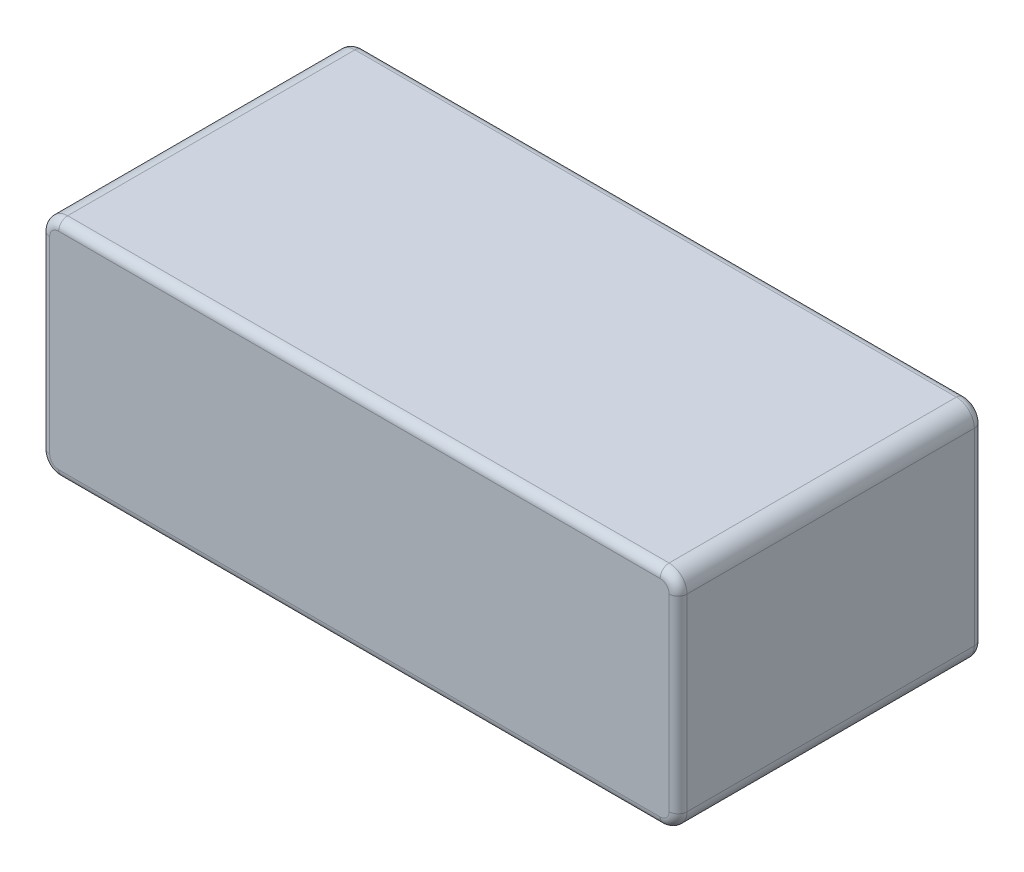
ISO-10303-21;
HEADER;
FILE_DESCRIPTION(('STEP AP214'),'2;1');
FILE_NAME('part.step','',(''),(''),'','','');
FILE_SCHEMA(('AUTOMOTIVE_DESIGN { 1 0 10303 214 1 1 1 1 }'));
ENDSEC;
DATA;
#1=APPLICATION_CONTEXT('core data for automotive mechanical design processes');
#2=APPLICATION_PROTOCOL_DEFINITION('international standard','automotive_design',2000,#1);
#3=PRODUCT_CONTEXT('',#1,'mechanical');
#4=PRODUCT('Part','Part','',(#3));
#5=PRODUCT_RELATED_PRODUCT_CATEGORY('part','',(#4));
#6=PRODUCT_DEFINITION_FORMATION('','',#4);
#7=PRODUCT_DEFINITION_CONTEXT('part definition',#1,'design');
#8=PRODUCT_DEFINITION('design','',#6,#7);
#9=PRODUCT_DEFINITION_SHAPE('','',#8);
#10=(LENGTH_UNIT() NAMED_UNIT(*) SI_UNIT(.MILLI.,.METRE.));
#11=(NAMED_UNIT(*) PLANE_ANGLE_UNIT() SI_UNIT($,.RADIAN.));
#12=(NAMED_UNIT(*) SI_UNIT($,.STERADIAN.) SOLID_ANGLE_UNIT());
#13=UNCERTAINTY_MEASURE_WITH_UNIT(LENGTH_MEASURE(1.E-05),#10,'distance_accuracy_value','');
#14=(GEOMETRIC_REPRESENTATION_CONTEXT(3) GLOBAL_UNCERTAINTY_ASSIGNED_CONTEXT((#13)) GLOBAL_UNIT_ASSIGNED_CONTEXT((#10,
#11,#12)) REPRESENTATION_CONTEXT('',''));
#15=CARTESIAN_POINT('',(0.,0.,0.));
#16=DIRECTION('',(0.,0.,1.));
#17=DIRECTION('',(1.,0.,0.));
#18=AXIS2_PLACEMENT_3D('',#15,#16,#17);
#19=CARTESIAN_POINT('',(71.,0.,34.));
#20=DIRECTION('',(-1.,0.,0.));
#21=DIRECTION('',(0.,0.,1.));
#22=AXIS2_PLACEMENT_3D('',#19,#20,#21);
#23=PLANE('',#22);
#24=DIRECTION('',(0.,0.,-1.));
#25=VECTOR('',#24,1.);
#26=CARTESIAN_POINT('',(71.,2.,34.));
#27=LINE('',#26,#25);
#28=CARTESIAN_POINT('',(71.,2.,33.));
#29=VERTEX_POINT('',#28);
#30=CARTESIAN_POINT('',(71.,2.,1.));
#31=VERTEX_POINT('',#30);
#32=EDGE_CURVE('E329',#29,#31,#27,.T.);
#33=ORIENTED_EDGE('',*,*,#32,.T.);
#34=DIRECTION('',(0.,1.,0.));
#35=VECTOR('',#34,1.);
#36=CARTESIAN_POINT('',(71.,23.,1.));
#37=LINE('',#36,#35);
#38=CARTESIAN_POINT('',(71.,23.,1.));
#39=VERTEX_POINT('',#38);
#40=EDGE_CURVE('E243',#31,#39,#37,.T.);
#41=ORIENTED_EDGE('',*,*,#40,.T.);
#42=DIRECTION('',(0.,0.,-1.));
#43=VECTOR('',#42,1.);
#44=CARTESIAN_POINT('',(71.,23.,34.));
#45=LINE('',#44,#43);
#46=CARTESIAN_POINT('',(71.,23.,33.));
#47=VERTEX_POINT('',#46);
#48=EDGE_CURVE('E326',#39,#47,#45,.F.);
#49=ORIENTED_EDGE('',*,*,#48,.T.);
#50=DIRECTION('',(0.,1.,0.));
#51=VECTOR('',#50,1.);
#52=CARTESIAN_POINT('',(71.,0.,33.));
#53=LINE('',#52,#51);
#54=EDGE_CURVE('E183',#47,#29,#53,.F.);
#55=ORIENTED_EDGE('',*,*,#54,.T.);
#56=EDGE_LOOP('',(#33,#41,#49,#55));
#57=FACE_BOUND('',#56,.T.);
#58=ADVANCED_FACE('F41',(#57),#23,.F.);
#59=CARTESIAN_POINT('',(0.,25.,34.));
#60=DIRECTION('',(0.,-1.,0.));
#61=DIRECTION('',(1.,0.,0.));
#62=AXIS2_PLACEMENT_3D('',#59,#60,#61);
#63=PLANE('',#62);
#64=DIRECTION('',(0.,0.,-1.));
#65=VECTOR('',#64,1.);
#66=CARTESIAN_POINT('',(69.,25.,34.));
#67=LINE('',#66,#65);
#68=CARTESIAN_POINT('',(69.,25.,33.));
#69=VERTEX_POINT('',#68);
#70=CARTESIAN_POINT('',(69.,25.,1.));
#71=VERTEX_POINT('',#70);
#72=EDGE_CURVE('E223',#69,#71,#67,.T.);
#73=ORIENTED_EDGE('',*,*,#72,.T.);
#74=DIRECTION('',(-1.,0.,0.));
#75=VECTOR('',#74,1.);
#76=CARTESIAN_POINT('',(1.99999999999999,25.,1.));
#77=LINE('',#76,#75);
#78=CARTESIAN_POINT('',(1.99999999999999,25.,1.));
#79=VERTEX_POINT('',#78);
#80=EDGE_CURVE('E11',#71,#79,#77,.T.);
#81=ORIENTED_EDGE('',*,*,#80,.T.);
#82=DIRECTION('',(0.,0.,-1.));
#83=VECTOR('',#82,1.);
#84=CARTESIAN_POINT('',(1.99999999999999,25.,34.));
#85=LINE('',#84,#83);
#86=CARTESIAN_POINT('',(1.99999999999999,25.,33.));
#87=VERTEX_POINT('',#86);
#88=EDGE_CURVE('E296',#79,#87,#85,.F.);
#89=ORIENTED_EDGE('',*,*,#88,.T.);
#90=DIRECTION('',(-1.,0.,0.));
#91=VECTOR('',#90,1.);
#92=CARTESIAN_POINT('',(0.,25.,33.));
#93=LINE('',#92,#91);
#94=EDGE_CURVE('E203',#87,#69,#93,.F.);
#95=ORIENTED_EDGE('',*,*,#94,.T.);
#96=EDGE_LOOP('',(#73,#81,#89,#95));
#97=FACE_BOUND('',#96,.T.);
#98=ADVANCED_FACE('F345',(#97),#63,.F.);
#99=CARTESIAN_POINT('',(0.,25.,34.));
#100=DIRECTION('',(1.,0.,0.));
#101=DIRECTION('',(0.,1.,0.));
#102=AXIS2_PLACEMENT_3D('',#99,#100,#101);
#103=PLANE('',#102);
#104=DIRECTION('',(0.,0.,-1.));
#105=VECTOR('',#104,1.);
#106=CARTESIAN_POINT('',(0.,23.,34.));
#107=LINE('',#106,#105);
#108=CARTESIAN_POINT('',(0.,23.,33.));
#109=VERTEX_POINT('',#108);
#110=CARTESIAN_POINT('',(0.,23.,1.));
#111=VERTEX_POINT('',#110);
#112=EDGE_CURVE('E299',#109,#111,#107,.T.);
#113=ORIENTED_EDGE('',*,*,#112,.T.);
#114=DIRECTION('',(0.,-1.,0.));
#115=VECTOR('',#114,1.);
#116=CARTESIAN_POINT('',(0.,2.,1.));
#117=LINE('',#116,#115);
#118=CARTESIAN_POINT('',(0.,2.,1.));
#119=VERTEX_POINT('',#118);
#120=EDGE_CURVE('E251',#111,#119,#117,.T.);
#121=ORIENTED_EDGE('',*,*,#120,.T.);
#122=DIRECTION('',(0.,0.,-1.));
#123=VECTOR('',#122,1.);
#124=CARTESIAN_POINT('',(0.,2.,34.));
#125=LINE('',#124,#123);
#126=CARTESIAN_POINT('',(0.,2.,33.));
#127=VERTEX_POINT('',#126);
#128=EDGE_CURVE('E176',#119,#127,#125,.F.);
#129=ORIENTED_EDGE('',*,*,#128,.T.);
#130=DIRECTION('',(0.,-1.,0.));
#131=VECTOR('',#130,1.);
#132=CARTESIAN_POINT('',(0.,25.,33.));
#133=LINE('',#132,#131);
#134=EDGE_CURVE('E198',#127,#109,#133,.F.);
#135=ORIENTED_EDGE('',*,*,#134,.T.);
#136=EDGE_LOOP('',(#113,#121,#129,#135));
#137=FACE_BOUND('',#136,.T.);
#138=ADVANCED_FACE('F335',(#137),#103,.F.);
#139=CARTESIAN_POINT('',(0.,0.,34.));
#140=DIRECTION('',(0.,1.,0.));
#141=DIRECTION('',(0.,0.,1.));
#142=AXIS2_PLACEMENT_3D('',#139,#140,#141);
#143=PLANE('',#142);
#144=DIRECTION('',(0.,0.,-1.));
#145=VECTOR('',#144,1.);
#146=CARTESIAN_POINT('',(2.,0.,34.));
#147=LINE('',#146,#145);
#148=CARTESIAN_POINT('',(2.,0.,33.));
#149=VERTEX_POINT('',#148);
#150=CARTESIAN_POINT('',(2.,0.,1.));
#151=VERTEX_POINT('',#150);
#152=EDGE_CURVE('E290',#149,#151,#147,.T.);
#153=ORIENTED_EDGE('',*,*,#152,.T.);
#154=DIRECTION('',(1.,0.,0.));
#155=VECTOR('',#154,1.);
#156=CARTESIAN_POINT('',(69.,0.,1.));
#157=LINE('',#156,#155);
#158=CARTESIAN_POINT('',(69.,0.,1.));
#159=VERTEX_POINT('',#158);
#160=EDGE_CURVE('E247',#151,#159,#157,.T.);
#161=ORIENTED_EDGE('',*,*,#160,.T.);
#162=DIRECTION('',(0.,0.,-1.));
#163=VECTOR('',#162,1.);
#164=CARTESIAN_POINT('',(69.,0.,34.));
#165=LINE('',#164,#163);
#166=CARTESIAN_POINT('',(69.,0.,33.));
#167=VERTEX_POINT('',#166);
#168=EDGE_CURVE('E333',#159,#167,#165,.F.);
#169=ORIENTED_EDGE('',*,*,#168,.T.);
#170=DIRECTION('',(1.,0.,0.));
#171=VECTOR('',#170,1.);
#172=CARTESIAN_POINT('',(0.,0.,33.));
#173=LINE('',#172,#171);
#174=EDGE_CURVE('E193',#167,#149,#173,.F.);
#175=ORIENTED_EDGE('',*,*,#174,.T.);
#176=EDGE_LOOP('',(#153,#161,#169,#175));
#177=FACE_BOUND('',#176,.T.);
#178=ADVANCED_FACE('F293',(#177),#143,.F.);
#179=CARTESIAN_POINT('',(0.,0.,34.));
#180=DIRECTION('',(0.,0.,-1.));
#181=DIRECTION('',(-1.,0.,0.));
#182=AXIS2_PLACEMENT_3D('',#179,#180,#181);
#183=PLANE('',#182);
#184=DIRECTION('',(0.,1.,0.));
#185=VECTOR('',#184,1.);
#186=CARTESIAN_POINT('',(70.,0.,34.));
#187=LINE('',#186,#185);
#188=CARTESIAN_POINT('',(70.,2.,34.));
#189=VERTEX_POINT('',#188);
#190=CARTESIAN_POINT('',(70.,23.,34.));
#191=VERTEX_POINT('',#190);
#192=EDGE_CURVE('E180',#189,#191,#187,.T.);
#193=ORIENTED_EDGE('',*,*,#192,.T.);
#194=CARTESIAN_POINT('',(69.,23.,34.));
#195=DIRECTION('',(0.,0.,-1.));
#196=DIRECTION('',(-1.,0.,0.));
#197=AXIS2_PLACEMENT_3D('',#194,#195,#196);
#198=CIRCLE('',#197,1.);
#199=CARTESIAN_POINT('',(69.,24.,34.));
#200=VERTEX_POINT('',#199);
#201=EDGE_CURVE('E161',#191,#200,#198,.F.);
#202=ORIENTED_EDGE('',*,*,#201,.T.);
#203=DIRECTION('',(-1.,0.,0.));
#204=VECTOR('',#203,1.);
#205=CARTESIAN_POINT('',(0.,24.,34.));
#206=LINE('',#205,#204);
#207=CARTESIAN_POINT('',(1.99999999999999,24.,34.));
#208=VERTEX_POINT('',#207);
#209=EDGE_CURVE('E169',#200,#208,#206,.T.);
#210=ORIENTED_EDGE('',*,*,#209,.T.);
#211=CARTESIAN_POINT('',(1.99999999999999,23.,34.));
#212=DIRECTION('',(0.,0.,-1.));
#213=DIRECTION('',(-1.,0.,0.));
#214=AXIS2_PLACEMENT_3D('',#211,#212,#213);
#215=CIRCLE('',#214,1.);
#216=CARTESIAN_POINT('',(0.999999999999993,23.,34.));
#217=VERTEX_POINT('',#216);
#218=EDGE_CURVE('E175',#208,#217,#215,.F.);
#219=ORIENTED_EDGE('',*,*,#218,.T.);
#220=DIRECTION('',(0.,-1.,0.));
#221=VECTOR('',#220,1.);
#222=CARTESIAN_POINT('',(1.,0.,34.));
#223=LINE('',#222,#221);
#224=CARTESIAN_POINT('',(0.999999999999999,2.,34.));
#225=VERTEX_POINT('',#224);
#226=EDGE_CURVE('E304',#217,#225,#223,.T.);
#227=ORIENTED_EDGE('',*,*,#226,.T.);
#228=CARTESIAN_POINT('',(2.,2.,34.));
#229=DIRECTION('',(0.,0.,-1.));
#230=DIRECTION('',(-1.,0.,0.));
#231=AXIS2_PLACEMENT_3D('',#228,#229,#230);
#232=CIRCLE('',#231,1.);
#233=CARTESIAN_POINT('',(2.,1.,34.));
#234=VERTEX_POINT('',#233);
#235=EDGE_CURVE('E306',#225,#234,#232,.F.);
#236=ORIENTED_EDGE('',*,*,#235,.T.);
#237=DIRECTION('',(1.,0.,0.));
#238=VECTOR('',#237,1.);
#239=CARTESIAN_POINT('',(0.,1.,34.));
#240=LINE('',#239,#238);
#241=CARTESIAN_POINT('',(69.,1.,34.));
#242=VERTEX_POINT('',#241);
#243=EDGE_CURVE('E308',#234,#242,#240,.T.);
#244=ORIENTED_EDGE('',*,*,#243,.T.);
#245=CARTESIAN_POINT('',(69.,2.,34.));
#246=DIRECTION('',(0.,0.,-1.));
#247=DIRECTION('',(-1.,0.,0.));
#248=AXIS2_PLACEMENT_3D('',#245,#246,#247);
#249=CIRCLE('',#248,1.);
#250=EDGE_CURVE('E185',#242,#189,#249,.F.);
#251=ORIENTED_EDGE('',*,*,#250,.T.);
#252=EDGE_LOOP('',(#193,#202,#210,#219,#227,#236,#244,#251));
#253=FACE_BOUND('',#252,.T.);
#254=ADVANCED_FACE('F178',(#253),#183,.F.);
#255=CARTESIAN_POINT('',(0.,0.,0.));
#256=DIRECTION('',(0.,0.,-1.));
#257=DIRECTION('',(-1.,0.,0.));
#258=AXIS2_PLACEMENT_3D('',#255,#256,#257);
#259=PLANE('',#258);
#260=DIRECTION('',(-1.,0.,0.));
#261=VECTOR('',#260,1.);
#262=CARTESIAN_POINT('',(69.,24.,0.));
#263=LINE('',#262,#261);
#264=CARTESIAN_POINT('',(1.99999999999999,24.,0.));
#265=VERTEX_POINT('',#264);
#266=CARTESIAN_POINT('',(69.,24.,0.));
#267=VERTEX_POINT('',#266);
#268=EDGE_CURVE('E204',#265,#267,#263,.F.);
#269=ORIENTED_EDGE('',*,*,#268,.T.);
#270=CARTESIAN_POINT('',(69.,23.,0.));
#271=DIRECTION('',(0.,0.,-1.));
#272=DIRECTION('',(-1.,0.,0.));
#273=AXIS2_PLACEMENT_3D('',#270,#271,#272);
#274=CIRCLE('',#273,1.);
#275=CARTESIAN_POINT('',(70.,23.,0.));
#276=VERTEX_POINT('',#275);
#277=EDGE_CURVE('E237',#267,#276,#274,.T.);
#278=ORIENTED_EDGE('',*,*,#277,.T.);
#279=DIRECTION('',(0.,1.,0.));
#280=VECTOR('',#279,1.);
#281=CARTESIAN_POINT('',(70.,2.,0.));
#282=LINE('',#281,#280);
#283=CARTESIAN_POINT('',(70.,2.,0.));
#284=VERTEX_POINT('',#283);
#285=EDGE_CURVE('E235',#276,#284,#282,.F.);
#286=ORIENTED_EDGE('',*,*,#285,.T.);
#287=CARTESIAN_POINT('',(69.,2.,0.));
#288=DIRECTION('',(0.,0.,-1.));
#289=DIRECTION('',(-1.,0.,0.));
#290=AXIS2_PLACEMENT_3D('',#287,#288,#289);
#291=CIRCLE('',#290,1.);
#292=CARTESIAN_POINT('',(69.,1.,0.));
#293=VERTEX_POINT('',#292);
#294=EDGE_CURVE('E233',#284,#293,#291,.T.);
#295=ORIENTED_EDGE('',*,*,#294,.T.);
#296=DIRECTION('',(1.,0.,0.));
#297=VECTOR('',#296,1.);
#298=CARTESIAN_POINT('',(2.,1.,0.));
#299=LINE('',#298,#297);
#300=CARTESIAN_POINT('',(2.,1.,0.));
#301=VERTEX_POINT('',#300);
#302=EDGE_CURVE('E231',#293,#301,#299,.F.);
#303=ORIENTED_EDGE('',*,*,#302,.T.);
#304=CARTESIAN_POINT('',(2.,2.,0.));
#305=DIRECTION('',(0.,0.,-1.));
#306=DIRECTION('',(-1.,0.,0.));
#307=AXIS2_PLACEMENT_3D('',#304,#305,#306);
#308=CIRCLE('',#307,1.);
#309=CARTESIAN_POINT('',(1.,2.,0.));
#310=VERTEX_POINT('',#309);
#311=EDGE_CURVE('E229',#301,#310,#308,.T.);
#312=ORIENTED_EDGE('',*,*,#311,.T.);
#313=DIRECTION('',(0.,-1.,0.));
#314=VECTOR('',#313,1.);
#315=CARTESIAN_POINT('',(0.999999999999993,23.,0.));
#316=LINE('',#315,#314);
#317=CARTESIAN_POINT('',(0.999999999999993,23.,0.));
#318=VERTEX_POINT('',#317);
#319=EDGE_CURVE('E227',#310,#318,#316,.F.);
#320=ORIENTED_EDGE('',*,*,#319,.T.);
#321=CARTESIAN_POINT('',(1.99999999999999,23.,0.));
#322=DIRECTION('',(0.,0.,-1.));
#323=DIRECTION('',(-1.,0.,0.));
#324=AXIS2_PLACEMENT_3D('',#321,#322,#323);
#325=CIRCLE('',#324,1.);
#326=EDGE_CURVE('E225',#318,#265,#325,.T.);
#327=ORIENTED_EDGE('',*,*,#326,.T.);
#328=EDGE_LOOP('',(#269,#278,#286,#295,#303,#312,#320,#327));
#329=FACE_BOUND('',#328,.T.);
#330=ADVANCED_FACE('F356',(#329),#259,.T.);
#331=CARTESIAN_POINT('',(69.,23.,34.));
#332=DIRECTION('',(0.,0.,-1.));
#333=DIRECTION('',(-1.,0.,0.));
#334=AXIS2_PLACEMENT_3D('',#331,#332,#333);
#335=CYLINDRICAL_SURFACE('',#334,2.);
#336=ORIENTED_EDGE('',*,*,#48,.F.);
#337=CARTESIAN_POINT('',(69.,23.,1.));
#338=DIRECTION('',(0.,0.,-1.));
#339=DIRECTION('',(-1.,0.,0.));
#340=AXIS2_PLACEMENT_3D('',#337,#338,#339);
#341=CIRCLE('',#340,2.);
#342=EDGE_CURVE('E240',#39,#71,#341,.F.);
#343=ORIENTED_EDGE('',*,*,#342,.T.);
#344=ORIENTED_EDGE('',*,*,#72,.F.);
#345=CARTESIAN_POINT('',(69.,23.,33.));
#346=DIRECTION('',(0.,0.,-1.));
#347=DIRECTION('',(-1.,0.,0.));
#348=AXIS2_PLACEMENT_3D('',#345,#346,#347);
#349=CIRCLE('',#348,2.);
#350=EDGE_CURVE('E163',#69,#47,#349,.T.);
#351=ORIENTED_EDGE('',*,*,#350,.T.);
#352=EDGE_LOOP('',(#336,#343,#344,#351));
#353=FACE_BOUND('',#352,.T.);
#354=ADVANCED_FACE('F325',(#353),#335,.T.);
#355=CARTESIAN_POINT('',(69.,2.,34.));
#356=DIRECTION('',(0.,0.,-1.));
#357=DIRECTION('',(-1.,0.,0.));
#358=AXIS2_PLACEMENT_3D('',#355,#356,#357);
#359=CYLINDRICAL_SURFACE('',#358,2.);
#360=ORIENTED_EDGE('',*,*,#168,.F.);
#361=CARTESIAN_POINT('',(69.,2.,1.));
#362=DIRECTION('',(0.,0.,-1.));
#363=DIRECTION('',(-1.,0.,0.));
#364=AXIS2_PLACEMENT_3D('',#361,#362,#363);
#365=CIRCLE('',#364,2.);
#366=EDGE_CURVE('E245',#159,#31,#365,.F.);
#367=ORIENTED_EDGE('',*,*,#366,.T.);
#368=ORIENTED_EDGE('',*,*,#32,.F.);
#369=CARTESIAN_POINT('',(69.,2.,33.));
#370=DIRECTION('',(0.,0.,-1.));
#371=DIRECTION('',(-1.,0.,0.));
#372=AXIS2_PLACEMENT_3D('',#369,#370,#371);
#373=CIRCLE('',#372,2.);
#374=EDGE_CURVE('E190',#29,#167,#373,.T.);
#375=ORIENTED_EDGE('',*,*,#374,.T.);
#376=EDGE_LOOP('',(#360,#367,#368,#375));
#377=FACE_BOUND('',#376,.T.);
#378=ADVANCED_FACE('F366',(#377),#359,.T.);
#379=CARTESIAN_POINT('',(1.99999999999999,23.,34.));
#380=DIRECTION('',(0.,0.,-1.));
#381=DIRECTION('',(-1.,0.,0.));
#382=AXIS2_PLACEMENT_3D('',#379,#380,#381);
#383=CYLINDRICAL_SURFACE('',#382,2.);
#384=ORIENTED_EDGE('',*,*,#88,.F.);
#385=CARTESIAN_POINT('',(1.99999999999999,23.,1.));
#386=DIRECTION('',(0.,0.,-1.));
#387=DIRECTION('',(-1.,0.,0.));
#388=AXIS2_PLACEMENT_3D('',#385,#386,#387);
#389=CIRCLE('',#388,2.);
#390=EDGE_CURVE('E50',#79,#111,#389,.F.);
#391=ORIENTED_EDGE('',*,*,#390,.T.);
#392=ORIENTED_EDGE('',*,*,#112,.F.);
#393=CARTESIAN_POINT('',(1.99999999999999,23.,33.));
#394=DIRECTION('',(0.,0.,-1.));
#395=DIRECTION('',(-1.,0.,0.));
#396=AXIS2_PLACEMENT_3D('',#393,#394,#395);
#397=CIRCLE('',#396,2.);
#398=EDGE_CURVE('E200',#109,#87,#397,.T.);
#399=ORIENTED_EDGE('',*,*,#398,.T.);
#400=EDGE_LOOP('',(#384,#391,#392,#399));
#401=FACE_BOUND('',#400,.T.);
#402=ADVANCED_FACE('F338',(#401),#383,.T.);
#403=CARTESIAN_POINT('',(2.,2.,34.));
#404=DIRECTION('',(0.,0.,-1.));
#405=DIRECTION('',(-1.,0.,0.));
#406=AXIS2_PLACEMENT_3D('',#403,#404,#405);
#407=CYLINDRICAL_SURFACE('',#406,2.);
#408=ORIENTED_EDGE('',*,*,#128,.F.);
#409=CARTESIAN_POINT('',(2.,2.,1.));
#410=DIRECTION('',(0.,0.,-1.));
#411=DIRECTION('',(-1.,0.,0.));
#412=AXIS2_PLACEMENT_3D('',#409,#410,#411);
#413=CIRCLE('',#412,2.);
#414=EDGE_CURVE('E249',#119,#151,#413,.F.);
#415=ORIENTED_EDGE('',*,*,#414,.T.);
#416=ORIENTED_EDGE('',*,*,#152,.F.);
#417=CARTESIAN_POINT('',(2.,2.,33.));
#418=DIRECTION('',(0.,0.,-1.));
#419=DIRECTION('',(-1.,0.,0.));
#420=AXIS2_PLACEMENT_3D('',#417,#418,#419);
#421=CIRCLE('',#420,2.);
#422=EDGE_CURVE('E195',#149,#127,#421,.T.);
#423=ORIENTED_EDGE('',*,*,#422,.T.);
#424=EDGE_LOOP('',(#408,#415,#416,#423));
#425=FACE_BOUND('',#424,.T.);
#426=ADVANCED_FACE('F289',(#425),#407,.T.);
#427=CARTESIAN_POINT('',(2.,2.,33.));
#428=DIRECTION('',(0.,0.,-1.));
#429=DIRECTION('',(-1.,0.,0.));
#430=AXIS2_PLACEMENT_3D('',#427,#428,#429);
#431=DEGENERATE_TOROIDAL_SURFACE('',#430,1.,1.,.T.);
#432=CARTESIAN_POINT('',(0.999999999999999,2.,33.));
#433=DIRECTION('',(0.,1.,0.));
#434=DIRECTION('',(-1.,0.,0.));
#435=AXIS2_PLACEMENT_3D('',#432,#433,#434);
#436=CIRCLE('',#435,1.);
#437=EDGE_CURVE('E217',#127,#225,#436,.T.);
#438=ORIENTED_EDGE('',*,*,#437,.F.);
#439=ORIENTED_EDGE('',*,*,#422,.F.);
#440=CARTESIAN_POINT('',(2.,1.,33.));
#441=DIRECTION('',(1.,0.,0.));
#442=DIRECTION('',(0.,0.,-1.));
#443=AXIS2_PLACEMENT_3D('',#440,#441,#442);
#444=CIRCLE('',#443,1.);
#445=EDGE_CURVE('E220',#234,#149,#444,.T.);
#446=ORIENTED_EDGE('',*,*,#445,.F.);
#447=ORIENTED_EDGE('',*,*,#235,.F.);
#448=EDGE_LOOP('',(#438,#439,#446,#447));
#449=FACE_BOUND('',#448,.T.);
#450=ADVANCED_FACE('F396',(#449),#431,.T.);
#451=CARTESIAN_POINT('',(0.,1.,33.));
#452=DIRECTION('',(1.,0.,0.));
#453=DIRECTION('',(0.,0.,-1.));
#454=AXIS2_PLACEMENT_3D('',#451,#452,#453);
#455=CYLINDRICAL_SURFACE('',#454,1.);
#456=ORIENTED_EDGE('',*,*,#445,.T.);
#457=ORIENTED_EDGE('',*,*,#174,.F.);
#458=CARTESIAN_POINT('',(69.,1.,33.));
#459=DIRECTION('',(1.,0.,0.));
#460=DIRECTION('',(0.,0.,-1.));
#461=AXIS2_PLACEMENT_3D('',#458,#459,#460);
#462=CIRCLE('',#461,1.);
#463=EDGE_CURVE('E214',#242,#167,#462,.T.);
#464=ORIENTED_EDGE('',*,*,#463,.F.);
#465=ORIENTED_EDGE('',*,*,#243,.F.);
#466=EDGE_LOOP('',(#456,#457,#464,#465));
#467=FACE_BOUND('',#466,.T.);
#468=ADVANCED_FACE('F409',(#467),#455,.T.);
#469=CARTESIAN_POINT('',(1.,0.,33.));
#470=DIRECTION('',(0.,-1.,0.));
#471=DIRECTION('',(1.,0.,0.));
#472=AXIS2_PLACEMENT_3D('',#469,#470,#471);
#473=CYLINDRICAL_SURFACE('',#472,1.);
#474=ORIENTED_EDGE('',*,*,#437,.T.);
#475=ORIENTED_EDGE('',*,*,#226,.F.);
#476=CARTESIAN_POINT('',(0.999999999999993,23.,33.));
#477=DIRECTION('',(0.,1.,0.));
#478=DIRECTION('',(0.,0.,1.));
#479=AXIS2_PLACEMENT_3D('',#476,#477,#478);
#480=CIRCLE('',#479,1.);
#481=EDGE_CURVE('E211',#109,#217,#480,.T.);
#482=ORIENTED_EDGE('',*,*,#481,.F.);
#483=ORIENTED_EDGE('',*,*,#134,.F.);
#484=EDGE_LOOP('',(#474,#475,#482,#483));
#485=FACE_BOUND('',#484,.T.);
#486=ADVANCED_FACE('F342',(#485),#473,.T.);
#487=CARTESIAN_POINT('',(69.,2.,33.));
#488=DIRECTION('',(0.,0.,-1.));
#489=DIRECTION('',(-1.,0.,0.));
#490=AXIS2_PLACEMENT_3D('',#487,#488,#489);
#491=DEGENERATE_TOROIDAL_SURFACE('',#490,1.,1.,.T.);
#492=ORIENTED_EDGE('',*,*,#463,.T.);
#493=ORIENTED_EDGE('',*,*,#374,.F.);
#494=CARTESIAN_POINT('',(70.,2.,33.));
#495=DIRECTION('',(0.,1.,0.));
#496=DIRECTION('',(0.,0.,1.));
#497=AXIS2_PLACEMENT_3D('',#494,#495,#496);
#498=CIRCLE('',#497,1.);
#499=EDGE_CURVE('E208',#189,#29,#498,.T.);
#500=ORIENTED_EDGE('',*,*,#499,.F.);
#501=ORIENTED_EDGE('',*,*,#250,.F.);
#502=EDGE_LOOP('',(#492,#493,#500,#501));
#503=FACE_BOUND('',#502,.T.);
#504=ADVANCED_FACE('F315',(#503),#491,.T.);
#505=CARTESIAN_POINT('',(1.99999999999999,23.,33.));
#506=DIRECTION('',(0.,0.,-1.));
#507=DIRECTION('',(-1.,0.,0.));
#508=AXIS2_PLACEMENT_3D('',#505,#506,#507);
#509=DEGENERATE_TOROIDAL_SURFACE('',#508,1.,1.,.T.);
#510=ORIENTED_EDGE('',*,*,#481,.T.);
#511=ORIENTED_EDGE('',*,*,#218,.F.);
#512=CARTESIAN_POINT('',(1.99999999999999,24.,33.));
#513=DIRECTION('',(1.,0.,0.));
#514=DIRECTION('',(0.,0.,-1.));
#515=AXIS2_PLACEMENT_3D('',#512,#513,#514);
#516=CIRCLE('',#515,1.);
#517=EDGE_CURVE('E172',#87,#208,#516,.T.);
#518=ORIENTED_EDGE('',*,*,#517,.F.);
#519=ORIENTED_EDGE('',*,*,#398,.F.);
#520=EDGE_LOOP('',(#510,#511,#518,#519));
#521=FACE_BOUND('',#520,.T.);
#522=ADVANCED_FACE('F344',(#521),#509,.T.);
#523=CARTESIAN_POINT('',(70.,0.,33.));
#524=DIRECTION('',(0.,1.,0.));
#525=DIRECTION('',(0.,0.,1.));
#526=AXIS2_PLACEMENT_3D('',#523,#524,#525);
#527=CYLINDRICAL_SURFACE('',#526,1.);
#528=ORIENTED_EDGE('',*,*,#499,.T.);
#529=ORIENTED_EDGE('',*,*,#54,.F.);
#530=CARTESIAN_POINT('',(70.,23.,33.));
#531=DIRECTION('',(0.,1.,0.));
#532=DIRECTION('',(0.,0.,1.));
#533=AXIS2_PLACEMENT_3D('',#530,#531,#532);
#534=CIRCLE('',#533,1.);
#535=EDGE_CURVE('E166',#191,#47,#534,.T.);
#536=ORIENTED_EDGE('',*,*,#535,.F.);
#537=ORIENTED_EDGE('',*,*,#192,.F.);
#538=EDGE_LOOP('',(#528,#529,#536,#537));
#539=FACE_BOUND('',#538,.T.);
#540=ADVANCED_FACE('F318',(#539),#527,.T.);
#541=CARTESIAN_POINT('',(0.,24.,33.));
#542=DIRECTION('',(-1.,0.,0.));
#543=DIRECTION('',(0.,-1.,0.));
#544=AXIS2_PLACEMENT_3D('',#541,#542,#543);
#545=CYLINDRICAL_SURFACE('',#544,1.);
#546=ORIENTED_EDGE('',*,*,#517,.T.);
#547=ORIENTED_EDGE('',*,*,#209,.F.);
#548=CARTESIAN_POINT('',(69.,24.,33.));
#549=DIRECTION('',(1.,0.,0.));
#550=DIRECTION('',(0.,0.,-1.));
#551=AXIS2_PLACEMENT_3D('',#548,#549,#550);
#552=CIRCLE('',#551,1.);
#553=EDGE_CURVE('E156',#69,#200,#552,.T.);
#554=ORIENTED_EDGE('',*,*,#553,.F.);
#555=ORIENTED_EDGE('',*,*,#94,.F.);
#556=EDGE_LOOP('',(#546,#547,#554,#555));
#557=FACE_BOUND('',#556,.T.);
#558=ADVANCED_FACE('F170',(#557),#545,.T.);
#559=CARTESIAN_POINT('',(69.,23.,33.));
#560=DIRECTION('',(0.,0.,-1.));
#561=DIRECTION('',(-1.,0.,0.));
#562=AXIS2_PLACEMENT_3D('',#559,#560,#561);
#563=DEGENERATE_TOROIDAL_SURFACE('',#562,1.,1.,.T.);
#564=ORIENTED_EDGE('',*,*,#535,.T.);
#565=ORIENTED_EDGE('',*,*,#350,.F.);
#566=ORIENTED_EDGE('',*,*,#553,.T.);
#567=ORIENTED_EDGE('',*,*,#201,.F.);
#568=EDGE_LOOP('',(#564,#565,#566,#567));
#569=FACE_BOUND('',#568,.T.);
#570=ADVANCED_FACE('F159',(#569),#563,.T.);
#571=CARTESIAN_POINT('',(2.,2.,1.));
#572=DIRECTION('',(0.,0.,-1.));
#573=DIRECTION('',(-1.,0.,0.));
#574=AXIS2_PLACEMENT_3D('',#571,#572,#573);
#575=DEGENERATE_TOROIDAL_SURFACE('',#574,1.,1.,.T.);
#576=CARTESIAN_POINT('',(2.,1.,1.));
#577=DIRECTION('',(1.,0.,0.));
#578=DIRECTION('',(0.,0.,-1.));
#579=AXIS2_PLACEMENT_3D('',#576,#577,#578);
#580=CIRCLE('',#579,1.);
#581=EDGE_CURVE('E269',#151,#301,#580,.T.);
#582=ORIENTED_EDGE('',*,*,#581,.F.);
#583=ORIENTED_EDGE('',*,*,#414,.F.);
#584=CARTESIAN_POINT('',(1.,2.,1.));
#585=DIRECTION('',(0.,1.,0.));
#586=DIRECTION('',(-1.,0.,0.));
#587=AXIS2_PLACEMENT_3D('',#584,#585,#586);
#588=CIRCLE('',#587,1.);
#589=EDGE_CURVE('E45',#310,#119,#588,.T.);
#590=ORIENTED_EDGE('',*,*,#589,.F.);
#591=ORIENTED_EDGE('',*,*,#311,.F.);
#592=EDGE_LOOP('',(#582,#583,#590,#591));
#593=FACE_BOUND('',#592,.T.);
#594=ADVANCED_FACE('F43',(#593),#575,.T.);
#595=CARTESIAN_POINT('',(0.999999999999993,25.,1.));
#596=DIRECTION('',(0.,1.,0.));
#597=DIRECTION('',(-1.,0.,0.));
#598=AXIS2_PLACEMENT_3D('',#595,#596,#597);
#599=CYLINDRICAL_SURFACE('',#598,1.);
#600=ORIENTED_EDGE('',*,*,#589,.T.);
#601=ORIENTED_EDGE('',*,*,#120,.F.);
#602=CARTESIAN_POINT('',(0.999999999999993,23.,1.));
#603=DIRECTION('',(0.,1.,0.));
#604=DIRECTION('',(0.,0.,1.));
#605=AXIS2_PLACEMENT_3D('',#602,#603,#604);
#606=CIRCLE('',#605,1.);
#607=EDGE_CURVE('E267',#318,#111,#606,.T.);
#608=ORIENTED_EDGE('',*,*,#607,.F.);
#609=ORIENTED_EDGE('',*,*,#319,.F.);
#610=EDGE_LOOP('',(#600,#601,#608,#609));
#611=FACE_BOUND('',#610,.T.);
#612=ADVANCED_FACE('F280',(#611),#599,.T.);
#613=CARTESIAN_POINT('',(0.,1.,1.));
#614=DIRECTION('',(-1.,0.,0.));
#615=DIRECTION('',(0.,0.,1.));
#616=AXIS2_PLACEMENT_3D('',#613,#614,#615);
#617=CYLINDRICAL_SURFACE('',#616,1.);
#618=ORIENTED_EDGE('',*,*,#581,.T.);
#619=ORIENTED_EDGE('',*,*,#302,.F.);
#620=CARTESIAN_POINT('',(69.,1.,1.));
#621=DIRECTION('',(1.,0.,0.));
#622=DIRECTION('',(0.,0.,-1.));
#623=AXIS2_PLACEMENT_3D('',#620,#621,#622);
#624=CIRCLE('',#623,1.);
#625=EDGE_CURVE('E264',#159,#293,#624,.T.);
#626=ORIENTED_EDGE('',*,*,#625,.F.);
#627=ORIENTED_EDGE('',*,*,#160,.F.);
#628=EDGE_LOOP('',(#618,#619,#626,#627));
#629=FACE_BOUND('',#628,.T.);
#630=ADVANCED_FACE('F359',(#629),#617,.T.);
#631=CARTESIAN_POINT('',(1.99999999999999,23.,1.));
#632=DIRECTION('',(0.,0.,-1.));
#633=DIRECTION('',(-1.,0.,0.));
#634=AXIS2_PLACEMENT_3D('',#631,#632,#633);
#635=DEGENERATE_TOROIDAL_SURFACE('',#634,1.,1.,.T.);
#636=ORIENTED_EDGE('',*,*,#607,.T.);
#637=ORIENTED_EDGE('',*,*,#390,.F.);
#638=CARTESIAN_POINT('',(1.99999999999999,24.,1.));
#639=DIRECTION('',(1.,0.,0.));
#640=DIRECTION('',(0.,0.,-1.));
#641=AXIS2_PLACEMENT_3D('',#638,#639,#640);
#642=CIRCLE('',#641,1.);
#643=EDGE_CURVE('E261',#265,#79,#642,.T.);
#644=ORIENTED_EDGE('',*,*,#643,.F.);
#645=ORIENTED_EDGE('',*,*,#326,.F.);
#646=EDGE_LOOP('',(#636,#637,#644,#645));
#647=FACE_BOUND('',#646,.T.);
#648=ADVANCED_FACE('F348',(#647),#635,.T.);
#649=CARTESIAN_POINT('',(69.,2.,1.));
#650=DIRECTION('',(0.,0.,-1.));
#651=DIRECTION('',(-1.,0.,0.));
#652=AXIS2_PLACEMENT_3D('',#649,#650,#651);
#653=DEGENERATE_TOROIDAL_SURFACE('',#652,1.,1.,.T.);
#654=ORIENTED_EDGE('',*,*,#625,.T.);
#655=ORIENTED_EDGE('',*,*,#294,.F.);
#656=CARTESIAN_POINT('',(70.,2.,1.));
#657=DIRECTION('',(0.,1.,0.));
#658=DIRECTION('',(0.,0.,1.));
#659=AXIS2_PLACEMENT_3D('',#656,#657,#658);
#660=CIRCLE('',#659,1.);
#661=EDGE_CURVE('E258',#31,#284,#660,.T.);
#662=ORIENTED_EDGE('',*,*,#661,.F.);
#663=ORIENTED_EDGE('',*,*,#366,.F.);
#664=EDGE_LOOP('',(#654,#655,#662,#663));
#665=FACE_BOUND('',#664,.T.);
#666=ADVANCED_FACE('F362',(#665),#653,.T.);
#667=CARTESIAN_POINT('',(0.,24.,1.));
#668=DIRECTION('',(1.,0.,0.));
#669=DIRECTION('',(0.,1.,0.));
#670=AXIS2_PLACEMENT_3D('',#667,#668,#669);
#671=CYLINDRICAL_SURFACE('',#670,1.);
#672=ORIENTED_EDGE('',*,*,#643,.T.);
#673=ORIENTED_EDGE('',*,*,#80,.F.);
#674=CARTESIAN_POINT('',(69.,24.,1.));
#675=DIRECTION('',(1.,0.,0.));
#676=DIRECTION('',(0.,0.,-1.));
#677=AXIS2_PLACEMENT_3D('',#674,#675,#676);
#678=CIRCLE('',#677,1.);
#679=EDGE_CURVE('E256',#267,#71,#678,.T.);
#680=ORIENTED_EDGE('',*,*,#679,.F.);
#681=ORIENTED_EDGE('',*,*,#268,.F.);
#682=EDGE_LOOP('',(#672,#673,#680,#681));
#683=FACE_BOUND('',#682,.T.);
#684=ADVANCED_FACE('F352',(#683),#671,.T.);
#685=CARTESIAN_POINT('',(70.,0.,1.));
#686=DIRECTION('',(0.,-1.,0.));
#687=DIRECTION('',(0.,0.,-1.));
#688=AXIS2_PLACEMENT_3D('',#685,#686,#687);
#689=CYLINDRICAL_SURFACE('',#688,1.);
#690=ORIENTED_EDGE('',*,*,#661,.T.);
#691=ORIENTED_EDGE('',*,*,#285,.F.);
#692=CARTESIAN_POINT('',(70.,23.,1.));
#693=DIRECTION('',(0.,1.,0.));
#694=DIRECTION('',(0.,0.,1.));
#695=AXIS2_PLACEMENT_3D('',#692,#693,#694);
#696=CIRCLE('',#695,1.);
#697=EDGE_CURVE('E254',#39,#276,#696,.T.);
#698=ORIENTED_EDGE('',*,*,#697,.F.);
#699=ORIENTED_EDGE('',*,*,#40,.F.);
#700=EDGE_LOOP('',(#690,#691,#698,#699));
#701=FACE_BOUND('',#700,.T.);
#702=ADVANCED_FACE('F369',(#701),#689,.T.);
#703=CARTESIAN_POINT('',(69.,23.,1.));
#704=DIRECTION('',(0.,0.,-1.));
#705=DIRECTION('',(-1.,0.,0.));
#706=AXIS2_PLACEMENT_3D('',#703,#704,#705);
#707=DEGENERATE_TOROIDAL_SURFACE('',#706,1.,1.,.T.);
#708=ORIENTED_EDGE('',*,*,#679,.T.);
#709=ORIENTED_EDGE('',*,*,#342,.F.);
#710=ORIENTED_EDGE('',*,*,#697,.T.);
#711=ORIENTED_EDGE('',*,*,#277,.F.);
#712=EDGE_LOOP('',(#708,#709,#710,#711));
#713=FACE_BOUND('',#712,.T.);
#714=ADVANCED_FACE('F372',(#713),#707,.T.);
#715=CLOSED_SHELL('',(#58,#98,#138,#178,#254,#330,#354,#378,#402,#426,#450,#468,#486,#504,#522,
#540,#558,#570,#594,#612,#630,#648,#666,#684,#702,#714));
#716=MANIFOLD_SOLID_BREP('B2',#715);
#717=ADVANCED_BREP_SHAPE_REPRESENTATION('',(#18,#716),#14);
#718=SHAPE_DEFINITION_REPRESENTATION(#9,#717);
ENDSEC;
END-ISO-10303-21;
